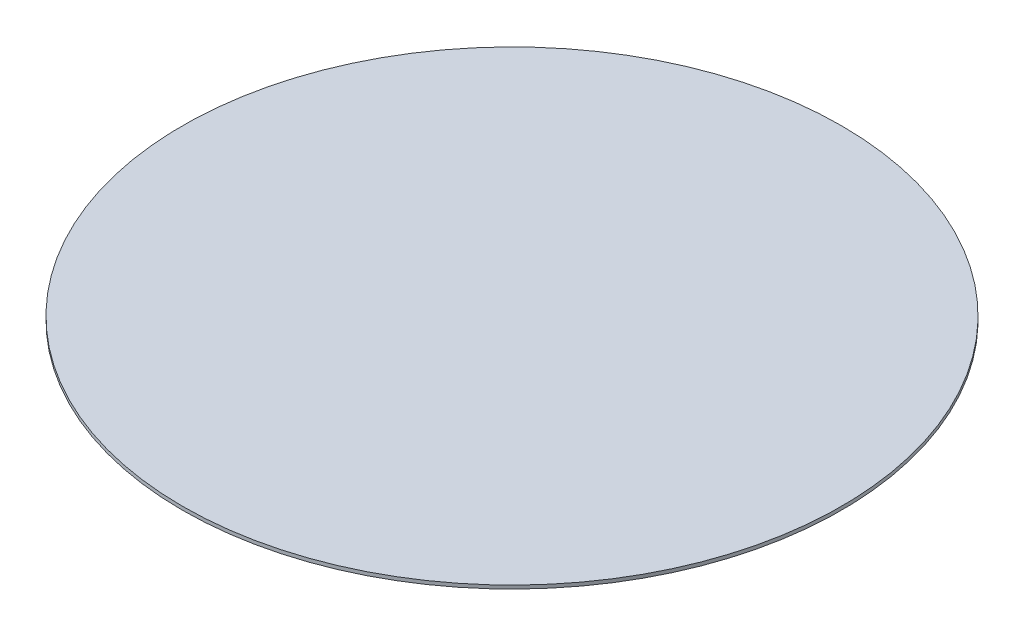
ISO-10303-21;
HEADER;
FILE_DESCRIPTION(('STEP AP214'),'2;1');
FILE_NAME('part.step','',(''),(''),'','','');
FILE_SCHEMA(('AUTOMOTIVE_DESIGN { 1 0 10303 214 1 1 1 1 }'));
ENDSEC;
DATA;
#1=APPLICATION_CONTEXT('core data for automotive mechanical design processes');
#2=APPLICATION_PROTOCOL_DEFINITION('international standard','automotive_design',2000,#1);
#3=PRODUCT_CONTEXT('',#1,'mechanical');
#4=PRODUCT('Part','Part','',(#3));
#5=PRODUCT_RELATED_PRODUCT_CATEGORY('part','',(#4));
#6=PRODUCT_DEFINITION_FORMATION('','',#4);
#7=PRODUCT_DEFINITION_CONTEXT('part definition',#1,'design');
#8=PRODUCT_DEFINITION('design','',#6,#7);
#9=PRODUCT_DEFINITION_SHAPE('','',#8);
#10=(LENGTH_UNIT() NAMED_UNIT(*) SI_UNIT(.MILLI.,.METRE.));
#11=(NAMED_UNIT(*) PLANE_ANGLE_UNIT() SI_UNIT($,.RADIAN.));
#12=(NAMED_UNIT(*) SI_UNIT($,.STERADIAN.) SOLID_ANGLE_UNIT());
#13=UNCERTAINTY_MEASURE_WITH_UNIT(LENGTH_MEASURE(1.E-05),#10,'distance_accuracy_value','');
#14=(GEOMETRIC_REPRESENTATION_CONTEXT(3) GLOBAL_UNCERTAINTY_ASSIGNED_CONTEXT((#13)) GLOBAL_UNIT_ASSIGNED_CONTEXT((#10,
#11,#12)) REPRESENTATION_CONTEXT('',''));
#15=CARTESIAN_POINT('',(0.,0.,0.));
#16=DIRECTION('',(0.,0.,1.));
#17=DIRECTION('',(1.,0.,0.));
#18=AXIS2_PLACEMENT_3D('',#15,#16,#17);
#19=CARTESIAN_POINT('',(0.,0.1,0.));
#20=DIRECTION('',(0.,-1.,0.));
#21=DIRECTION('',(0.,0.,-1.));
#22=AXIS2_PLACEMENT_3D('',#19,#20,#21);
#23=CYLINDRICAL_SURFACE('',#22,9.5);
#24=CARTESIAN_POINT('',(0.,0.1,0.));
#25=DIRECTION('',(0.,1.,0.));
#26=DIRECTION('',(0.,0.,1.));
#27=AXIS2_PLACEMENT_3D('',#24,#25,#26);
#28=CIRCLE('',#27,9.5);
#29=CARTESIAN_POINT('',(0.,0.1,9.5));
#30=VERTEX_POINT('',#29);
#31=EDGE_CURVE('E10',#30,#30,#28,.T.);
#32=ORIENTED_EDGE('',*,*,#31,.F.);
#33=EDGE_LOOP('',(#32));
#34=FACE_BOUND('',#33,.T.);
#35=CARTESIAN_POINT('',(0.,0.,0.));
#36=DIRECTION('',(0.,1.,0.));
#37=DIRECTION('',(0.,0.,1.));
#38=AXIS2_PLACEMENT_3D('',#35,#36,#37);
#39=CIRCLE('',#38,9.5);
#40=CARTESIAN_POINT('',(0.,0.,9.5));
#41=VERTEX_POINT('',#40);
#42=EDGE_CURVE('E34',#41,#41,#39,.T.);
#43=ORIENTED_EDGE('',*,*,#42,.T.);
#44=EDGE_LOOP('',(#43));
#45=FACE_BOUND('',#44,.T.);
#46=ADVANCED_FACE('F31',(#34,#45),#23,.T.);
#47=CARTESIAN_POINT('',(0.,0.1,0.));
#48=DIRECTION('',(0.,1.,0.));
#49=DIRECTION('',(0.,0.,1.));
#50=AXIS2_PLACEMENT_3D('',#47,#48,#49);
#51=PLANE('',#50);
#52=ORIENTED_EDGE('',*,*,#31,.T.);
#53=EDGE_LOOP('',(#52));
#54=FACE_BOUND('',#53,.T.);
#55=ADVANCED_FACE('F46',(#54),#51,.T.);
#56=CARTESIAN_POINT('',(0.,0.,0.));
#57=DIRECTION('',(0.,1.,0.));
#58=DIRECTION('',(0.,0.,1.));
#59=AXIS2_PLACEMENT_3D('',#56,#57,#58);
#60=PLANE('',#59);
#61=ORIENTED_EDGE('',*,*,#42,.F.);
#62=EDGE_LOOP('',(#61));
#63=FACE_BOUND('',#62,.T.);
#64=ADVANCED_FACE('F44',(#63),#60,.F.);
#65=CLOSED_SHELL('',(#46,#55,#64));
#66=MANIFOLD_SOLID_BREP('B2',#65);
#67=ADVANCED_BREP_SHAPE_REPRESENTATION('',(#18,#66),#14);
#68=SHAPE_DEFINITION_REPRESENTATION(#9,#67);
ENDSEC;
END-ISO-10303-21;
